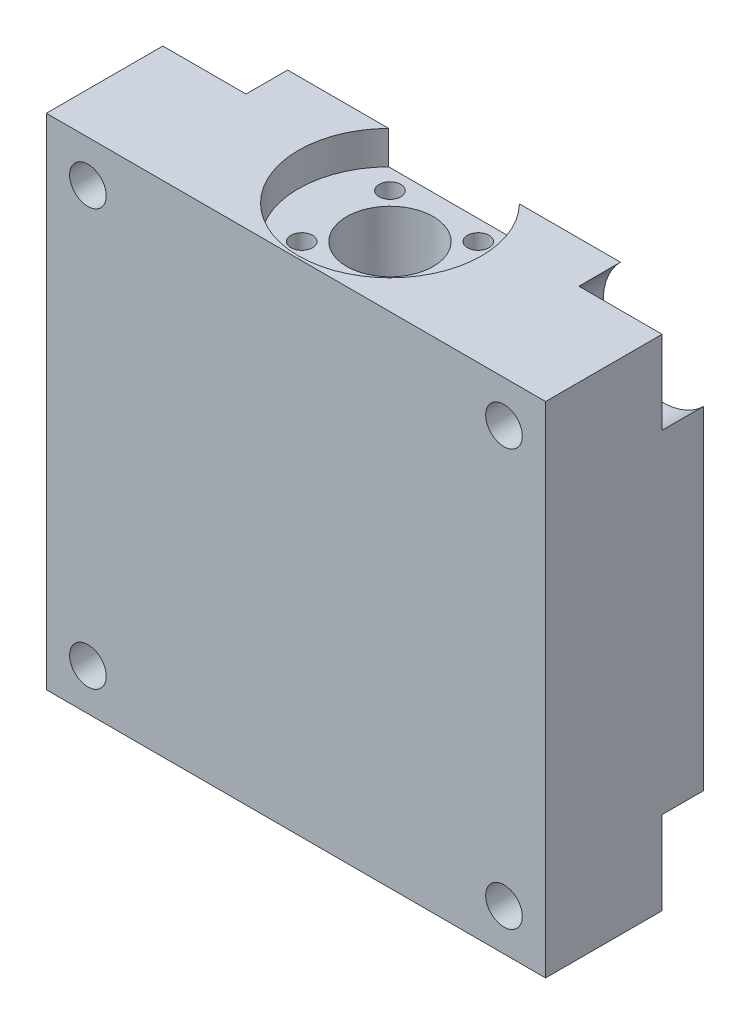
ISO-10303-21;
HEADER;
FILE_DESCRIPTION(('STEP AP214'),'2;1');
FILE_NAME('part.step','',(''),(''),'','','');
FILE_SCHEMA(('AUTOMOTIVE_DESIGN { 1 0 10303 214 1 1 1 1 }'));
ENDSEC;
DATA;
#1=APPLICATION_CONTEXT('core data for automotive mechanical design processes');
#2=APPLICATION_PROTOCOL_DEFINITION('international standard','automotive_design',2000,#1);
#3=PRODUCT_CONTEXT('',#1,'mechanical');
#4=PRODUCT('Part','Part','',(#3));
#5=PRODUCT_RELATED_PRODUCT_CATEGORY('part','',(#4));
#6=PRODUCT_DEFINITION_FORMATION('','',#4);
#7=PRODUCT_DEFINITION_CONTEXT('part definition',#1,'design');
#8=PRODUCT_DEFINITION('design','',#6,#7);
#9=PRODUCT_DEFINITION_SHAPE('','',#8);
#10=(LENGTH_UNIT() NAMED_UNIT(*) SI_UNIT(.MILLI.,.METRE.));
#11=(NAMED_UNIT(*) PLANE_ANGLE_UNIT() SI_UNIT($,.RADIAN.));
#12=(NAMED_UNIT(*) SI_UNIT($,.STERADIAN.) SOLID_ANGLE_UNIT());
#13=UNCERTAINTY_MEASURE_WITH_UNIT(LENGTH_MEASURE(1.E-05),#10,'distance_accuracy_value','');
#14=(GEOMETRIC_REPRESENTATION_CONTEXT(3) GLOBAL_UNCERTAINTY_ASSIGNED_CONTEXT((#13)) GLOBAL_UNIT_ASSIGNED_CONTEXT((#10,
#11,#12)) REPRESENTATION_CONTEXT('',''));
#15=CARTESIAN_POINT('',(0.,0.,0.));
#16=DIRECTION('',(0.,0.,1.));
#17=DIRECTION('',(1.,0.,0.));
#18=AXIS2_PLACEMENT_3D('',#15,#16,#17);
#19=CARTESIAN_POINT('',(25.,-25.,19.));
#20=DIRECTION('',(0.,0.,-1.));
#21=DIRECTION('',(-1.,0.,0.));
#22=AXIS2_PLACEMENT_3D('',#19,#20,#21);
#23=CYLINDRICAL_SURFACE('',#22,2.2);
#24=CARTESIAN_POINT('',(25.,-25.,19.));
#25=DIRECTION('',(0.,0.,1.));
#26=DIRECTION('',(1.,0.,0.));
#27=AXIS2_PLACEMENT_3D('',#24,#25,#26);
#28=CIRCLE('',#27,2.2);
#29=CARTESIAN_POINT('',(27.2,-25.,19.));
#30=VERTEX_POINT('',#29);
#31=EDGE_CURVE('E293',#30,#30,#28,.T.);
#32=ORIENTED_EDGE('',*,*,#31,.T.);
#33=EDGE_LOOP('',(#32));
#34=FACE_BOUND('',#33,.T.);
#35=CARTESIAN_POINT('',(25.,-25.,5.));
#36=DIRECTION('',(0.,0.,-1.));
#37=DIRECTION('',(-1.,0.,0.));
#38=AXIS2_PLACEMENT_3D('',#35,#36,#37);
#39=CIRCLE('',#38,2.2);
#40=CARTESIAN_POINT('',(22.8,-25.,5.));
#41=VERTEX_POINT('',#40);
#42=EDGE_CURVE('E217',#41,#41,#39,.T.);
#43=ORIENTED_EDGE('',*,*,#42,.T.);
#44=EDGE_LOOP('',(#43));
#45=FACE_BOUND('',#44,.T.);
#46=ADVANCED_FACE('F33',(#34,#45),#23,.F.);
#47=CARTESIAN_POINT('',(-25.,-25.,19.));
#48=DIRECTION('',(0.,0.,-1.));
#49=DIRECTION('',(-1.,0.,0.));
#50=AXIS2_PLACEMENT_3D('',#47,#48,#49);
#51=CYLINDRICAL_SURFACE('',#50,2.2);
#52=CARTESIAN_POINT('',(-25.,-25.,19.));
#53=DIRECTION('',(0.,0.,1.));
#54=DIRECTION('',(1.,0.,0.));
#55=AXIS2_PLACEMENT_3D('',#52,#53,#54);
#56=CIRCLE('',#55,2.2);
#57=CARTESIAN_POINT('',(-22.8,-25.,19.));
#58=VERTEX_POINT('',#57);
#59=EDGE_CURVE('E290',#58,#58,#56,.T.);
#60=ORIENTED_EDGE('',*,*,#59,.T.);
#61=EDGE_LOOP('',(#60));
#62=FACE_BOUND('',#61,.T.);
#63=CARTESIAN_POINT('',(-25.,-25.,5.));
#64=DIRECTION('',(0.,0.,-1.));
#65=DIRECTION('',(-1.,0.,0.));
#66=AXIS2_PLACEMENT_3D('',#63,#64,#65);
#67=CIRCLE('',#66,2.2);
#68=CARTESIAN_POINT('',(-27.2,-25.,5.));
#69=VERTEX_POINT('',#68);
#70=EDGE_CURVE('E212',#69,#69,#67,.T.);
#71=ORIENTED_EDGE('',*,*,#70,.T.);
#72=EDGE_LOOP('',(#71));
#73=FACE_BOUND('',#72,.T.);
#74=ADVANCED_FACE('F355',(#62,#73),#51,.F.);
#75=CARTESIAN_POINT('',(-25.,25.,19.));
#76=DIRECTION('',(0.,0.,-1.));
#77=DIRECTION('',(-1.,0.,0.));
#78=AXIS2_PLACEMENT_3D('',#75,#76,#77);
#79=CYLINDRICAL_SURFACE('',#78,2.2);
#80=CARTESIAN_POINT('',(-25.,25.,19.));
#81=DIRECTION('',(0.,0.,1.));
#82=DIRECTION('',(1.,0.,0.));
#83=AXIS2_PLACEMENT_3D('',#80,#81,#82);
#84=CIRCLE('',#83,2.2);
#85=CARTESIAN_POINT('',(-22.8,25.,19.));
#86=VERTEX_POINT('',#85);
#87=EDGE_CURVE('E157',#86,#86,#84,.T.);
#88=ORIENTED_EDGE('',*,*,#87,.T.);
#89=EDGE_LOOP('',(#88));
#90=FACE_BOUND('',#89,.T.);
#91=CARTESIAN_POINT('',(-25.,25.,5.));
#92=DIRECTION('',(0.,0.,-1.));
#93=DIRECTION('',(-1.,0.,0.));
#94=AXIS2_PLACEMENT_3D('',#91,#92,#93);
#95=CIRCLE('',#94,2.2);
#96=CARTESIAN_POINT('',(-27.2,25.,5.));
#97=VERTEX_POINT('',#96);
#98=EDGE_CURVE('E205',#97,#97,#95,.T.);
#99=ORIENTED_EDGE('',*,*,#98,.T.);
#100=EDGE_LOOP('',(#99));
#101=FACE_BOUND('',#100,.T.);
#102=ADVANCED_FACE('F361',(#90,#101),#79,.F.);
#103=CARTESIAN_POINT('',(25.,25.,19.));
#104=DIRECTION('',(0.,0.,-1.));
#105=DIRECTION('',(-1.,0.,0.));
#106=AXIS2_PLACEMENT_3D('',#103,#104,#105);
#107=CYLINDRICAL_SURFACE('',#106,2.2);
#108=CARTESIAN_POINT('',(25.,25.,19.));
#109=DIRECTION('',(0.,0.,1.));
#110=DIRECTION('',(1.,0.,0.));
#111=AXIS2_PLACEMENT_3D('',#108,#109,#110);
#112=CIRCLE('',#111,2.2);
#113=CARTESIAN_POINT('',(27.2,25.,19.));
#114=VERTEX_POINT('',#113);
#115=EDGE_CURVE('E163',#114,#114,#112,.T.);
#116=ORIENTED_EDGE('',*,*,#115,.T.);
#117=EDGE_LOOP('',(#116));
#118=FACE_BOUND('',#117,.T.);
#119=CARTESIAN_POINT('',(25.,25.,5.));
#120=DIRECTION('',(0.,0.,-1.));
#121=DIRECTION('',(-1.,0.,0.));
#122=AXIS2_PLACEMENT_3D('',#119,#120,#121);
#123=CIRCLE('',#122,2.2);
#124=CARTESIAN_POINT('',(22.8,25.,5.));
#125=VERTEX_POINT('',#124);
#126=EDGE_CURVE('E197',#125,#125,#123,.T.);
#127=ORIENTED_EDGE('',*,*,#126,.T.);
#128=EDGE_LOOP('',(#127));
#129=FACE_BOUND('',#128,.T.);
#130=ADVANCED_FACE('F365',(#118,#129),#107,.F.);
#131=CARTESIAN_POINT('',(0.,-30.001,7.7));
#132=DIRECTION('',(0.,1.,0.));
#133=DIRECTION('',(0.,0.,1.));
#134=AXIS2_PLACEMENT_3D('',#131,#132,#133);
#135=CYLINDRICAL_SURFACE('',#134,5.2);
#136=CARTESIAN_POINT('',(0.,26.,7.7));
#137=DIRECTION('',(0.,1.,0.));
#138=DIRECTION('',(0.,0.,1.));
#139=AXIS2_PLACEMENT_3D('',#136,#137,#138);
#140=CIRCLE('',#139,5.2);
#141=CARTESIAN_POINT('',(0.,26.,12.9));
#142=VERTEX_POINT('',#141);
#143=EDGE_CURVE('E195',#142,#142,#140,.T.);
#144=ORIENTED_EDGE('',*,*,#143,.T.);
#145=EDGE_LOOP('',(#144));
#146=FACE_BOUND('',#145,.T.);
#147=CARTESIAN_POINT('',(0.,16.,7.7));
#148=DIRECTION('',(0.,-1.,0.));
#149=DIRECTION('',(0.,0.,-1.));
#150=AXIS2_PLACEMENT_3D('',#147,#148,#149);
#151=CIRCLE('',#150,5.2);
#152=CARTESIAN_POINT('',(0.,16.,2.5));
#153=VERTEX_POINT('',#152);
#154=EDGE_CURVE('E192',#153,#153,#151,.F.);
#155=ORIENTED_EDGE('',*,*,#154,.F.);
#156=EDGE_LOOP('',(#155));
#157=FACE_BOUND('',#156,.T.);
#158=ADVANCED_FACE('F368',(#146,#157),#135,.F.);
#159=CARTESIAN_POINT('',(0.,0.,19.));
#160=DIRECTION('',(0.,0.,1.));
#161=DIRECTION('',(1.,0.,0.));
#162=AXIS2_PLACEMENT_3D('',#159,#160,#161);
#163=PLANE('',#162);
#164=ORIENTED_EDGE('',*,*,#31,.F.);
#165=EDGE_LOOP('',(#164));
#166=FACE_BOUND('',#165,.T.);
#167=ORIENTED_EDGE('',*,*,#87,.F.);
#168=EDGE_LOOP('',(#167));
#169=FACE_BOUND('',#168,.T.);
#170=DIRECTION('',(0.,1.,0.));
#171=VECTOR('',#170,1.);
#172=CARTESIAN_POINT('',(30.,30.,19.));
#173=LINE('',#172,#171);
#174=CARTESIAN_POINT('',(30.,-30.,19.));
#175=VERTEX_POINT('',#174);
#176=CARTESIAN_POINT('',(30.,30.,19.));
#177=VERTEX_POINT('',#176);
#178=EDGE_CURVE('E174',#175,#177,#173,.T.);
#179=ORIENTED_EDGE('',*,*,#178,.T.);
#180=DIRECTION('',(-1.,0.,0.));
#181=VECTOR('',#180,1.);
#182=CARTESIAN_POINT('',(-30.,30.,19.));
#183=LINE('',#182,#181);
#184=CARTESIAN_POINT('',(-30.,30.,19.));
#185=VERTEX_POINT('',#184);
#186=EDGE_CURVE('E300',#177,#185,#183,.T.);
#187=ORIENTED_EDGE('',*,*,#186,.T.);
#188=DIRECTION('',(0.,-1.,0.));
#189=VECTOR('',#188,1.);
#190=CARTESIAN_POINT('',(-30.,30.,19.));
#191=LINE('',#190,#189);
#192=CARTESIAN_POINT('',(-30.,-30.,19.));
#193=VERTEX_POINT('',#192);
#194=EDGE_CURVE('E301',#185,#193,#191,.T.);
#195=ORIENTED_EDGE('',*,*,#194,.T.);
#196=DIRECTION('',(1.,0.,0.));
#197=VECTOR('',#196,1.);
#198=CARTESIAN_POINT('',(-30.,-30.,19.));
#199=LINE('',#198,#197);
#200=EDGE_CURVE('E166',#193,#175,#199,.T.);
#201=ORIENTED_EDGE('',*,*,#200,.T.);
#202=EDGE_LOOP('',(#179,#187,#195,#201));
#203=FACE_BOUND('',#202,.T.);
#204=ORIENTED_EDGE('',*,*,#115,.F.);
#205=EDGE_LOOP('',(#204));
#206=FACE_BOUND('',#205,.T.);
#207=ORIENTED_EDGE('',*,*,#59,.F.);
#208=EDGE_LOOP('',(#207));
#209=FACE_BOUND('',#208,.T.);
#210=ADVANCED_FACE('F307',(#166,#169,#203,#206,#209),#163,.T.);
#211=CARTESIAN_POINT('',(0.,0.,0.));
#212=DIRECTION('',(0.,0.,1.));
#213=DIRECTION('',(1.,0.,0.));
#214=AXIS2_PLACEMENT_3D('',#211,#212,#213);
#215=PLANE('',#214);
#216=DIRECTION('',(0.,1.,0.));
#217=VECTOR('',#216,1.);
#218=CARTESIAN_POINT('',(30.,30.,0.));
#219=LINE('',#218,#217);
#220=CARTESIAN_POINT('',(30.,-20.,0.));
#221=VERTEX_POINT('',#220);
#222=CARTESIAN_POINT('',(30.,20.,0.));
#223=VERTEX_POINT('',#222);
#224=EDGE_CURVE('E147',#221,#223,#219,.T.);
#225=ORIENTED_EDGE('',*,*,#224,.F.);
#226=CARTESIAN_POINT('',(25.,-25.,0.));
#227=DIRECTION('',(0.,0.,-1.));
#228=DIRECTION('',(-1.,0.,0.));
#229=AXIS2_PLACEMENT_3D('',#226,#227,#228);
#230=CIRCLE('',#229,7.07106781186547);
#231=CARTESIAN_POINT('',(20.,-30.,0.));
#232=VERTEX_POINT('',#231);
#233=EDGE_CURVE('E134',#232,#221,#230,.T.);
#234=ORIENTED_EDGE('',*,*,#233,.F.);
#235=DIRECTION('',(1.,0.,0.));
#236=VECTOR('',#235,1.);
#237=CARTESIAN_POINT('',(-30.,-30.,0.));
#238=LINE('',#237,#236);
#239=CARTESIAN_POINT('',(-20.,-30.,0.));
#240=VERTEX_POINT('',#239);
#241=EDGE_CURVE('E172',#240,#232,#238,.T.);
#242=ORIENTED_EDGE('',*,*,#241,.F.);
#243=CARTESIAN_POINT('',(-25.,-25.,0.));
#244=DIRECTION('',(0.,0.,-1.));
#245=DIRECTION('',(-1.,0.,0.));
#246=AXIS2_PLACEMENT_3D('',#243,#244,#245);
#247=CIRCLE('',#246,7.07106781186546);
#248=CARTESIAN_POINT('',(-30.,-20.,0.));
#249=VERTEX_POINT('',#248);
#250=EDGE_CURVE('E150',#249,#240,#247,.T.);
#251=ORIENTED_EDGE('',*,*,#250,.F.);
#252=DIRECTION('',(0.,-1.,0.));
#253=VECTOR('',#252,1.);
#254=CARTESIAN_POINT('',(-30.,30.,0.));
#255=LINE('',#254,#253);
#256=CARTESIAN_POINT('',(-30.,20.,0.));
#257=VERTEX_POINT('',#256);
#258=EDGE_CURVE('E169',#257,#249,#255,.T.);
#259=ORIENTED_EDGE('',*,*,#258,.F.);
#260=CARTESIAN_POINT('',(-25.,25.,0.));
#261=DIRECTION('',(0.,0.,-1.));
#262=DIRECTION('',(-1.,0.,0.));
#263=AXIS2_PLACEMENT_3D('',#260,#261,#262);
#264=CIRCLE('',#263,7.07106781186548);
#265=CARTESIAN_POINT('',(-20.,30.,0.));
#266=VERTEX_POINT('',#265);
#267=EDGE_CURVE('E234',#266,#257,#264,.T.);
#268=ORIENTED_EDGE('',*,*,#267,.F.);
#269=DIRECTION('',(-1.,0.,0.));
#270=VECTOR('',#269,1.);
#271=CARTESIAN_POINT('',(-30.,30.,0.));
#272=LINE('',#271,#270);
#273=CARTESIAN_POINT('',(-7.85557127139713,30.,0.));
#274=VERTEX_POINT('',#273);
#275=EDGE_CURVE('E156',#274,#266,#272,.T.);
#276=ORIENTED_EDGE('',*,*,#275,.F.);
#277=DIRECTION('',(0.,1.,0.));
#278=VECTOR('',#277,1.);
#279=CARTESIAN_POINT('',(-7.85557127139713,26.,0.));
#280=LINE('',#279,#278);
#281=CARTESIAN_POINT('',(-7.85557127139713,26.,0.));
#282=VERTEX_POINT('',#281);
#283=EDGE_CURVE('E284',#274,#282,#280,.F.);
#284=ORIENTED_EDGE('',*,*,#283,.T.);
#285=DIRECTION('',(-1.,0.,0.));
#286=VECTOR('',#285,1.);
#287=CARTESIAN_POINT('',(0.,26.,0.));
#288=LINE('',#287,#286);
#289=CARTESIAN_POINT('',(7.85557127139713,26.,0.));
#290=VERTEX_POINT('',#289);
#291=EDGE_CURVE('E189',#290,#282,#288,.T.);
#292=ORIENTED_EDGE('',*,*,#291,.F.);
#293=DIRECTION('',(0.,1.,0.));
#294=VECTOR('',#293,1.);
#295=CARTESIAN_POINT('',(7.85557127139713,26.,0.));
#296=LINE('',#295,#294);
#297=CARTESIAN_POINT('',(7.85557127139713,30.,0.));
#298=VERTEX_POINT('',#297);
#299=EDGE_CURVE('E287',#290,#298,#296,.T.);
#300=ORIENTED_EDGE('',*,*,#299,.T.);
#301=CARTESIAN_POINT('',(20.,30.,0.));
#302=VERTEX_POINT('',#301);
#303=EDGE_CURVE('E160',#302,#298,#272,.T.);
#304=ORIENTED_EDGE('',*,*,#303,.F.);
#305=CARTESIAN_POINT('',(25.,25.,0.));
#306=DIRECTION('',(0.,0.,-1.));
#307=DIRECTION('',(-1.,0.,0.));
#308=AXIS2_PLACEMENT_3D('',#305,#306,#307);
#309=CIRCLE('',#308,7.07106781186548);
#310=EDGE_CURVE('E155',#223,#302,#309,.T.);
#311=ORIENTED_EDGE('',*,*,#310,.F.);
#312=EDGE_LOOP('',(#225,#234,#242,#251,#259,#268,#276,#284,#292,#300,#304,#311));
#313=FACE_BOUND('',#312,.T.);
#314=ADVANCED_FACE('F153',(#313),#215,.F.);
#315=CARTESIAN_POINT('',(30.,30.,19.));
#316=DIRECTION('',(-1.,0.,0.));
#317=DIRECTION('',(0.,-1.,0.));
#318=AXIS2_PLACEMENT_3D('',#315,#316,#317);
#319=PLANE('',#318);
#320=DIRECTION('',(0.,-1.,0.));
#321=VECTOR('',#320,1.);
#322=CARTESIAN_POINT('',(30.,30.,5.));
#323=LINE('',#322,#321);
#324=CARTESIAN_POINT('',(30.,-20.,5.));
#325=VERTEX_POINT('',#324);
#326=CARTESIAN_POINT('',(30.,-30.,5.));
#327=VERTEX_POINT('',#326);
#328=EDGE_CURVE('E48',#325,#327,#323,.T.);
#329=ORIENTED_EDGE('',*,*,#328,.F.);
#330=DIRECTION('',(0.,0.,-1.));
#331=VECTOR('',#330,1.);
#332=CARTESIAN_POINT('',(30.,-20.,5.));
#333=LINE('',#332,#331);
#334=EDGE_CURVE('E138',#325,#221,#333,.T.);
#335=ORIENTED_EDGE('',*,*,#334,.T.);
#336=ORIENTED_EDGE('',*,*,#224,.T.);
#337=DIRECTION('',(0.,0.,-1.));
#338=VECTOR('',#337,1.);
#339=CARTESIAN_POINT('',(30.,20.,5.));
#340=LINE('',#339,#338);
#341=CARTESIAN_POINT('',(30.,20.,5.));
#342=VERTEX_POINT('',#341);
#343=EDGE_CURVE('E248',#223,#342,#340,.F.);
#344=ORIENTED_EDGE('',*,*,#343,.T.);
#345=DIRECTION('',(0.,-1.,0.));
#346=VECTOR('',#345,1.);
#347=CARTESIAN_POINT('',(30.,30.,5.));
#348=LINE('',#347,#346);
#349=CARTESIAN_POINT('',(30.,30.,5.));
#350=VERTEX_POINT('',#349);
#351=EDGE_CURVE('E246',#350,#342,#348,.T.);
#352=ORIENTED_EDGE('',*,*,#351,.F.);
#353=DIRECTION('',(0.,0.,-1.));
#354=VECTOR('',#353,1.);
#355=CARTESIAN_POINT('',(30.,30.,19.));
#356=LINE('',#355,#354);
#357=EDGE_CURVE('E183',#177,#350,#356,.T.);
#358=ORIENTED_EDGE('',*,*,#357,.F.);
#359=ORIENTED_EDGE('',*,*,#178,.F.);
#360=DIRECTION('',(0.,0.,-1.));
#361=VECTOR('',#360,1.);
#362=CARTESIAN_POINT('',(30.,-30.,19.));
#363=LINE('',#362,#361);
#364=EDGE_CURVE('E175',#175,#327,#363,.T.);
#365=ORIENTED_EDGE('',*,*,#364,.T.);
#366=EDGE_LOOP('',(#329,#335,#336,#344,#352,#358,#359,#365));
#367=FACE_BOUND('',#366,.T.);
#368=ADVANCED_FACE('F35',(#367),#319,.F.);
#369=CARTESIAN_POINT('',(-30.,30.,19.));
#370=DIRECTION('',(0.,-1.,0.));
#371=DIRECTION('',(0.,0.,-1.));
#372=AXIS2_PLACEMENT_3D('',#369,#370,#371);
#373=PLANE('',#372);
#374=ORIENTED_EDGE('',*,*,#275,.T.);
#375=DIRECTION('',(0.,0.,-1.));
#376=VECTOR('',#375,1.);
#377=CARTESIAN_POINT('',(-20.,30.,5.));
#378=LINE('',#377,#376);
#379=CARTESIAN_POINT('',(-20.,30.,5.));
#380=VERTEX_POINT('',#379);
#381=EDGE_CURVE('E240',#266,#380,#378,.F.);
#382=ORIENTED_EDGE('',*,*,#381,.T.);
#383=DIRECTION('',(1.,0.,0.));
#384=VECTOR('',#383,1.);
#385=CARTESIAN_POINT('',(-30.,30.,5.));
#386=LINE('',#385,#384);
#387=CARTESIAN_POINT('',(-30.,30.,5.));
#388=VERTEX_POINT('',#387);
#389=EDGE_CURVE('E238',#388,#380,#386,.T.);
#390=ORIENTED_EDGE('',*,*,#389,.F.);
#391=DIRECTION('',(0.,0.,-1.));
#392=VECTOR('',#391,1.);
#393=CARTESIAN_POINT('',(-30.,30.,19.));
#394=LINE('',#393,#392);
#395=EDGE_CURVE('E180',#185,#388,#394,.T.);
#396=ORIENTED_EDGE('',*,*,#395,.F.);
#397=ORIENTED_EDGE('',*,*,#186,.F.);
#398=ORIENTED_EDGE('',*,*,#357,.T.);
#399=DIRECTION('',(1.,0.,0.));
#400=VECTOR('',#399,1.);
#401=CARTESIAN_POINT('',(-30.,30.,5.));
#402=LINE('',#401,#400);
#403=CARTESIAN_POINT('',(20.,30.,5.));
#404=VERTEX_POINT('',#403);
#405=EDGE_CURVE('E200',#404,#350,#402,.T.);
#406=ORIENTED_EDGE('',*,*,#405,.F.);
#407=DIRECTION('',(0.,0.,-1.));
#408=VECTOR('',#407,1.);
#409=CARTESIAN_POINT('',(20.,30.,5.));
#410=LINE('',#409,#408);
#411=EDGE_CURVE('E191',#404,#302,#410,.T.);
#412=ORIENTED_EDGE('',*,*,#411,.T.);
#413=ORIENTED_EDGE('',*,*,#303,.T.);
#414=CARTESIAN_POINT('',(0.,30.,7.7));
#415=DIRECTION('',(0.,-1.,0.));
#416=DIRECTION('',(0.,0.,-1.));
#417=AXIS2_PLACEMENT_3D('',#414,#415,#416);
#418=CIRCLE('',#417,11.);
#419=EDGE_CURVE('E186',#298,#274,#418,.T.);
#420=ORIENTED_EDGE('',*,*,#419,.T.);
#421=EDGE_LOOP('',(#374,#382,#390,#396,#397,#398,#406,#412,#413,#420));
#422=FACE_BOUND('',#421,.T.);
#423=ADVANCED_FACE('F316',(#422),#373,.F.);
#424=CARTESIAN_POINT('',(-30.,30.,19.));
#425=DIRECTION('',(1.,0.,0.));
#426=DIRECTION('',(0.,1.,0.));
#427=AXIS2_PLACEMENT_3D('',#424,#425,#426);
#428=PLANE('',#427);
#429=ORIENTED_EDGE('',*,*,#258,.T.);
#430=DIRECTION('',(0.,0.,-1.));
#431=VECTOR('',#430,1.);
#432=CARTESIAN_POINT('',(-30.,-20.,5.));
#433=LINE('',#432,#431);
#434=CARTESIAN_POINT('',(-30.,-20.,5.));
#435=VERTEX_POINT('',#434);
#436=EDGE_CURVE('E231',#249,#435,#433,.F.);
#437=ORIENTED_EDGE('',*,*,#436,.T.);
#438=DIRECTION('',(0.,1.,0.));
#439=VECTOR('',#438,1.);
#440=CARTESIAN_POINT('',(-30.,30.,5.));
#441=LINE('',#440,#439);
#442=CARTESIAN_POINT('',(-30.,-30.,5.));
#443=VERTEX_POINT('',#442);
#444=EDGE_CURVE('E229',#443,#435,#441,.T.);
#445=ORIENTED_EDGE('',*,*,#444,.F.);
#446=DIRECTION('',(0.,0.,-1.));
#447=VECTOR('',#446,1.);
#448=CARTESIAN_POINT('',(-30.,-30.,19.));
#449=LINE('',#448,#447);
#450=EDGE_CURVE('E177',#193,#443,#449,.T.);
#451=ORIENTED_EDGE('',*,*,#450,.F.);
#452=ORIENTED_EDGE('',*,*,#194,.F.);
#453=ORIENTED_EDGE('',*,*,#395,.T.);
#454=DIRECTION('',(0.,1.,0.));
#455=VECTOR('',#454,1.);
#456=CARTESIAN_POINT('',(-30.,30.,5.));
#457=LINE('',#456,#455);
#458=CARTESIAN_POINT('',(-30.,20.,5.));
#459=VERTEX_POINT('',#458);
#460=EDGE_CURVE('E208',#459,#388,#457,.T.);
#461=ORIENTED_EDGE('',*,*,#460,.F.);
#462=DIRECTION('',(0.,0.,-1.));
#463=VECTOR('',#462,1.);
#464=CARTESIAN_POINT('',(-30.,20.,5.));
#465=LINE('',#464,#463);
#466=EDGE_CURVE('E204',#459,#257,#465,.T.);
#467=ORIENTED_EDGE('',*,*,#466,.T.);
#468=EDGE_LOOP('',(#429,#437,#445,#451,#452,#453,#461,#467));
#469=FACE_BOUND('',#468,.T.);
#470=ADVANCED_FACE('F321',(#469),#428,.F.);
#471=CARTESIAN_POINT('',(-30.,-30.,19.));
#472=DIRECTION('',(0.,1.,0.));
#473=DIRECTION('',(0.,0.,1.));
#474=AXIS2_PLACEMENT_3D('',#471,#472,#473);
#475=PLANE('',#474);
#476=CARTESIAN_POINT('',(0.,-30.,7.7));
#477=DIRECTION('',(0.,-1.,0.));
#478=DIRECTION('',(0.,0.,-1.));
#479=AXIS2_PLACEMENT_3D('',#476,#477,#478);
#480=CIRCLE('',#479,7.2);
#481=CARTESIAN_POINT('',(0.,-30.,0.5));
#482=VERTEX_POINT('',#481);
#483=EDGE_CURVE('E272',#482,#482,#480,.T.);
#484=ORIENTED_EDGE('',*,*,#483,.F.);
#485=EDGE_LOOP('',(#484));
#486=FACE_BOUND('',#485,.T.);
#487=ORIENTED_EDGE('',*,*,#241,.T.);
#488=DIRECTION('',(0.,0.,-1.));
#489=VECTOR('',#488,1.);
#490=CARTESIAN_POINT('',(20.,-30.,5.));
#491=LINE('',#490,#489);
#492=CARTESIAN_POINT('',(20.,-30.,5.));
#493=VERTEX_POINT('',#492);
#494=EDGE_CURVE('E11',#232,#493,#491,.F.);
#495=ORIENTED_EDGE('',*,*,#494,.T.);
#496=DIRECTION('',(-1.,0.,0.));
#497=VECTOR('',#496,1.);
#498=CARTESIAN_POINT('',(-30.,-30.,5.));
#499=LINE('',#498,#497);
#500=EDGE_CURVE('E219',#327,#493,#499,.T.);
#501=ORIENTED_EDGE('',*,*,#500,.F.);
#502=ORIENTED_EDGE('',*,*,#364,.F.);
#503=ORIENTED_EDGE('',*,*,#200,.F.);
#504=ORIENTED_EDGE('',*,*,#450,.T.);
#505=DIRECTION('',(-1.,0.,0.));
#506=VECTOR('',#505,1.);
#507=CARTESIAN_POINT('',(-30.,-30.,5.));
#508=LINE('',#507,#506);
#509=CARTESIAN_POINT('',(-20.,-30.,5.));
#510=VERTEX_POINT('',#509);
#511=EDGE_CURVE('E215',#510,#443,#508,.T.);
#512=ORIENTED_EDGE('',*,*,#511,.F.);
#513=DIRECTION('',(0.,0.,-1.));
#514=VECTOR('',#513,1.);
#515=CARTESIAN_POINT('',(-20.,-30.,5.));
#516=LINE('',#515,#514);
#517=EDGE_CURVE('E41',#510,#240,#516,.T.);
#518=ORIENTED_EDGE('',*,*,#517,.T.);
#519=EDGE_LOOP('',(#487,#495,#501,#502,#503,#504,#512,#518));
#520=FACE_BOUND('',#519,.T.);
#521=ADVANCED_FACE('F312',(#486,#520),#475,.F.);
#522=CARTESIAN_POINT('',(0.,26.,7.7));
#523=DIRECTION('',(0.,1.,0.));
#524=DIRECTION('',(0.,0.,1.));
#525=AXIS2_PLACEMENT_3D('',#522,#523,#524);
#526=PLANE('',#525);
#527=CARTESIAN_POINT('',(-5.3033008588991,26.,13.0033008588991));
#528=DIRECTION('',(0.,1.,0.));
#529=DIRECTION('',(0.,0.,1.));
#530=AXIS2_PLACEMENT_3D('',#527,#528,#529);
#531=CIRCLE('',#530,1.3);
#532=CARTESIAN_POINT('',(-5.3033008588991,26.,14.3033008588991));
#533=VERTEX_POINT('',#532);
#534=EDGE_CURVE('E250',#533,#533,#531,.T.);
#535=ORIENTED_EDGE('',*,*,#534,.F.);
#536=EDGE_LOOP('',(#535));
#537=FACE_BOUND('',#536,.T.);
#538=CARTESIAN_POINT('',(5.30330085889912,26.,13.0033008588991));
#539=DIRECTION('',(0.,1.,0.));
#540=DIRECTION('',(0.,0.,1.));
#541=AXIS2_PLACEMENT_3D('',#538,#539,#540);
#542=CIRCLE('',#541,1.3);
#543=CARTESIAN_POINT('',(5.30330085889912,26.,14.3033008588991));
#544=VERTEX_POINT('',#543);
#545=EDGE_CURVE('E254',#544,#544,#542,.T.);
#546=ORIENTED_EDGE('',*,*,#545,.F.);
#547=EDGE_LOOP('',(#546));
#548=FACE_BOUND('',#547,.T.);
#549=CARTESIAN_POINT('',(5.3033008588991,26.,2.39669914110088));
#550=DIRECTION('',(0.,1.,0.));
#551=DIRECTION('',(0.,0.,1.));
#552=AXIS2_PLACEMENT_3D('',#549,#550,#551);
#553=CIRCLE('',#552,1.3);
#554=CARTESIAN_POINT('',(5.3033008588991,26.,3.69669914110088));
#555=VERTEX_POINT('',#554);
#556=EDGE_CURVE('E260',#555,#555,#553,.T.);
#557=ORIENTED_EDGE('',*,*,#556,.F.);
#558=EDGE_LOOP('',(#557));
#559=FACE_BOUND('',#558,.T.);
#560=CARTESIAN_POINT('',(-5.30330085889912,26.,2.3966991411009));
#561=DIRECTION('',(0.,1.,0.));
#562=DIRECTION('',(0.,0.,1.));
#563=AXIS2_PLACEMENT_3D('',#560,#561,#562);
#564=CIRCLE('',#563,1.3);
#565=CARTESIAN_POINT('',(-5.30330085889912,26.,3.6966991411009));
#566=VERTEX_POINT('',#565);
#567=EDGE_CURVE('E266',#566,#566,#564,.T.);
#568=ORIENTED_EDGE('',*,*,#567,.F.);
#569=EDGE_LOOP('',(#568));
#570=FACE_BOUND('',#569,.T.);
#571=ORIENTED_EDGE('',*,*,#143,.F.);
#572=EDGE_LOOP('',(#571));
#573=FACE_BOUND('',#572,.T.);
#574=ORIENTED_EDGE('',*,*,#291,.T.);
#575=CARTESIAN_POINT('',(0.,26.,7.7));
#576=DIRECTION('',(0.,1.,0.));
#577=DIRECTION('',(0.,0.,1.));
#578=AXIS2_PLACEMENT_3D('',#575,#576,#577);
#579=CIRCLE('',#578,11.);
#580=EDGE_CURVE('E281',#282,#290,#579,.T.);
#581=ORIENTED_EDGE('',*,*,#580,.T.);
#582=EDGE_LOOP('',(#574,#581));
#583=FACE_BOUND('',#582,.T.);
#584=ADVANCED_FACE('F339',(#537,#548,#559,#570,#573,#583),#526,.T.);
#585=CARTESIAN_POINT('',(0.,26.,7.7));
#586=DIRECTION('',(0.,1.,0.));
#587=DIRECTION('',(0.,0.,1.));
#588=AXIS2_PLACEMENT_3D('',#585,#586,#587);
#589=CYLINDRICAL_SURFACE('',#588,11.);
#590=ORIENTED_EDGE('',*,*,#580,.F.);
#591=ORIENTED_EDGE('',*,*,#283,.F.);
#592=ORIENTED_EDGE('',*,*,#419,.F.);
#593=ORIENTED_EDGE('',*,*,#299,.F.);
#594=EDGE_LOOP('',(#590,#591,#592,#593));
#595=FACE_BOUND('',#594,.T.);
#596=ADVANCED_FACE('F336',(#595),#589,.F.);
#597=CARTESIAN_POINT('',(0.,16.,7.7));
#598=DIRECTION('',(0.,-1.,0.));
#599=DIRECTION('',(0.,0.,-1.));
#600=AXIS2_PLACEMENT_3D('',#597,#598,#599);
#601=PLANE('',#600);
#602=CARTESIAN_POINT('',(0.,16.,7.7));
#603=DIRECTION('',(0.,-1.,0.));
#604=DIRECTION('',(0.,0.,-1.));
#605=AXIS2_PLACEMENT_3D('',#602,#603,#604);
#606=CIRCLE('',#605,7.2);
#607=CARTESIAN_POINT('',(0.,16.,0.5));
#608=VERTEX_POINT('',#607);
#609=EDGE_CURVE('E196',#608,#608,#606,.T.);
#610=ORIENTED_EDGE('',*,*,#609,.T.);
#611=EDGE_LOOP('',(#610));
#612=FACE_BOUND('',#611,.T.);
#613=ORIENTED_EDGE('',*,*,#154,.T.);
#614=EDGE_LOOP('',(#613));
#615=FACE_BOUND('',#614,.T.);
#616=ADVANCED_FACE('F347',(#612,#615),#601,.T.);
#617=CARTESIAN_POINT('',(0.,16.,7.7));
#618=DIRECTION('',(0.,-1.,0.));
#619=DIRECTION('',(0.,0.,-1.));
#620=AXIS2_PLACEMENT_3D('',#617,#618,#619);
#621=CYLINDRICAL_SURFACE('',#620,7.2);
#622=ORIENTED_EDGE('',*,*,#609,.F.);
#623=EDGE_LOOP('',(#622));
#624=FACE_BOUND('',#623,.T.);
#625=ORIENTED_EDGE('',*,*,#483,.T.);
#626=EDGE_LOOP('',(#625));
#627=FACE_BOUND('',#626,.T.);
#628=ADVANCED_FACE('F499',(#624,#627),#621,.F.);
#629=CARTESIAN_POINT('',(-5.30330085889912,20.,2.3966991411009));
#630=DIRECTION('',(0.,1.,0.));
#631=DIRECTION('',(0.,0.,1.));
#632=AXIS2_PLACEMENT_3D('',#629,#630,#631);
#633=CYLINDRICAL_SURFACE('',#632,1.3);
#634=CARTESIAN_POINT('',(-5.30330085889912,20.,2.3966991411009));
#635=DIRECTION('',(0.,1.,0.));
#636=DIRECTION('',(0.,0.,1.));
#637=AXIS2_PLACEMENT_3D('',#634,#635,#636);
#638=CIRCLE('',#637,1.3);
#639=CARTESIAN_POINT('',(-5.30330085889912,20.,3.6966991411009));
#640=VERTEX_POINT('',#639);
#641=EDGE_CURVE('E269',#640,#640,#638,.T.);
#642=ORIENTED_EDGE('',*,*,#641,.F.);
#643=EDGE_LOOP('',(#642));
#644=FACE_BOUND('',#643,.T.);
#645=ORIENTED_EDGE('',*,*,#567,.T.);
#646=EDGE_LOOP('',(#645));
#647=FACE_BOUND('',#646,.T.);
#648=ADVANCED_FACE('F490',(#644,#647),#633,.F.);
#649=CARTESIAN_POINT('',(-5.30330085889912,20.,2.3966991411009));
#650=DIRECTION('',(0.,1.,0.));
#651=DIRECTION('',(0.,0.,1.));
#652=AXIS2_PLACEMENT_3D('',#649,#650,#651);
#653=PLANE('',#652);
#654=ORIENTED_EDGE('',*,*,#641,.T.);
#655=EDGE_LOOP('',(#654));
#656=FACE_BOUND('',#655,.T.);
#657=ADVANCED_FACE('F480',(#656),#653,.T.);
#658=CARTESIAN_POINT('',(5.3033008588991,20.,2.39669914110088));
#659=DIRECTION('',(0.,1.,0.));
#660=DIRECTION('',(0.,0.,1.));
#661=AXIS2_PLACEMENT_3D('',#658,#659,#660);
#662=CYLINDRICAL_SURFACE('',#661,1.3);
#663=CARTESIAN_POINT('',(5.3033008588991,20.,2.39669914110088));
#664=DIRECTION('',(0.,1.,0.));
#665=DIRECTION('',(0.,0.,1.));
#666=AXIS2_PLACEMENT_3D('',#663,#664,#665);
#667=CIRCLE('',#666,1.3);
#668=CARTESIAN_POINT('',(5.3033008588991,20.,3.69669914110088));
#669=VERTEX_POINT('',#668);
#670=EDGE_CURVE('E263',#669,#669,#667,.T.);
#671=ORIENTED_EDGE('',*,*,#670,.F.);
#672=EDGE_LOOP('',(#671));
#673=FACE_BOUND('',#672,.T.);
#674=ORIENTED_EDGE('',*,*,#556,.T.);
#675=EDGE_LOOP('',(#674));
#676=FACE_BOUND('',#675,.T.);
#677=ADVANCED_FACE('F470',(#673,#676),#662,.F.);
#678=CARTESIAN_POINT('',(5.3033008588991,20.,2.39669914110088));
#679=DIRECTION('',(0.,1.,0.));
#680=DIRECTION('',(0.,0.,1.));
#681=AXIS2_PLACEMENT_3D('',#678,#679,#680);
#682=PLANE('',#681);
#683=ORIENTED_EDGE('',*,*,#670,.T.);
#684=EDGE_LOOP('',(#683));
#685=FACE_BOUND('',#684,.T.);
#686=ADVANCED_FACE('F460',(#685),#682,.T.);
#687=CARTESIAN_POINT('',(5.30330085889912,20.,13.0033008588991));
#688=DIRECTION('',(0.,1.,0.));
#689=DIRECTION('',(0.,0.,1.));
#690=AXIS2_PLACEMENT_3D('',#687,#688,#689);
#691=CYLINDRICAL_SURFACE('',#690,1.3);
#692=CARTESIAN_POINT('',(5.30330085889912,20.,13.0033008588991));
#693=DIRECTION('',(0.,1.,0.));
#694=DIRECTION('',(0.,0.,1.));
#695=AXIS2_PLACEMENT_3D('',#692,#693,#694);
#696=CIRCLE('',#695,1.3);
#697=CARTESIAN_POINT('',(5.30330085889912,20.,14.3033008588991));
#698=VERTEX_POINT('',#697);
#699=EDGE_CURVE('E257',#698,#698,#696,.T.);
#700=ORIENTED_EDGE('',*,*,#699,.F.);
#701=EDGE_LOOP('',(#700));
#702=FACE_BOUND('',#701,.T.);
#703=ORIENTED_EDGE('',*,*,#545,.T.);
#704=EDGE_LOOP('',(#703));
#705=FACE_BOUND('',#704,.T.);
#706=ADVANCED_FACE('F450',(#702,#705),#691,.F.);
#707=CARTESIAN_POINT('',(5.30330085889912,20.,13.0033008588991));
#708=DIRECTION('',(0.,1.,0.));
#709=DIRECTION('',(0.,0.,1.));
#710=AXIS2_PLACEMENT_3D('',#707,#708,#709);
#711=PLANE('',#710);
#712=ORIENTED_EDGE('',*,*,#699,.T.);
#713=EDGE_LOOP('',(#712));
#714=FACE_BOUND('',#713,.T.);
#715=ADVANCED_FACE('F440',(#714),#711,.T.);
#716=CARTESIAN_POINT('',(-5.3033008588991,20.,13.0033008588991));
#717=DIRECTION('',(0.,1.,0.));
#718=DIRECTION('',(0.,0.,1.));
#719=AXIS2_PLACEMENT_3D('',#716,#717,#718);
#720=CYLINDRICAL_SURFACE('',#719,1.3);
#721=CARTESIAN_POINT('',(-5.3033008588991,20.,13.0033008588991));
#722=DIRECTION('',(0.,1.,0.));
#723=DIRECTION('',(0.,0.,1.));
#724=AXIS2_PLACEMENT_3D('',#721,#722,#723);
#725=CIRCLE('',#724,1.3);
#726=CARTESIAN_POINT('',(-5.3033008588991,20.,14.3033008588991));
#727=VERTEX_POINT('',#726);
#728=EDGE_CURVE('E251',#727,#727,#725,.T.);
#729=ORIENTED_EDGE('',*,*,#728,.F.);
#730=EDGE_LOOP('',(#729));
#731=FACE_BOUND('',#730,.T.);
#732=ORIENTED_EDGE('',*,*,#534,.T.);
#733=EDGE_LOOP('',(#732));
#734=FACE_BOUND('',#733,.T.);
#735=ADVANCED_FACE('F429',(#731,#734),#720,.F.);
#736=CARTESIAN_POINT('',(-5.3033008588991,20.,13.0033008588991));
#737=DIRECTION('',(0.,1.,0.));
#738=DIRECTION('',(0.,0.,1.));
#739=AXIS2_PLACEMENT_3D('',#736,#737,#738);
#740=PLANE('',#739);
#741=ORIENTED_EDGE('',*,*,#728,.T.);
#742=EDGE_LOOP('',(#741));
#743=FACE_BOUND('',#742,.T.);
#744=ADVANCED_FACE('F423',(#743),#740,.T.);
#745=CARTESIAN_POINT('',(25.,25.,5.));
#746=DIRECTION('',(0.,0.,-1.));
#747=DIRECTION('',(-1.,0.,0.));
#748=AXIS2_PLACEMENT_3D('',#745,#746,#747);
#749=CYLINDRICAL_SURFACE('',#748,7.07106781186548);
#750=ORIENTED_EDGE('',*,*,#310,.T.);
#751=ORIENTED_EDGE('',*,*,#411,.F.);
#752=CARTESIAN_POINT('',(25.,25.,5.));
#753=DIRECTION('',(0.,0.,-1.));
#754=DIRECTION('',(-1.,0.,0.));
#755=AXIS2_PLACEMENT_3D('',#752,#753,#754);
#756=CIRCLE('',#755,7.07106781186548);
#757=EDGE_CURVE('E201',#342,#404,#756,.T.);
#758=ORIENTED_EDGE('',*,*,#757,.F.);
#759=ORIENTED_EDGE('',*,*,#343,.F.);
#760=EDGE_LOOP('',(#750,#751,#758,#759));
#761=FACE_BOUND('',#760,.T.);
#762=ADVANCED_FACE('F428',(#761),#749,.F.);
#763=CARTESIAN_POINT('',(25.,25.,5.));
#764=DIRECTION('',(0.,0.,-1.));
#765=DIRECTION('',(-1.,0.,0.));
#766=AXIS2_PLACEMENT_3D('',#763,#764,#765);
#767=PLANE('',#766);
#768=ORIENTED_EDGE('',*,*,#126,.F.);
#769=EDGE_LOOP('',(#768));
#770=FACE_BOUND('',#769,.T.);
#771=ORIENTED_EDGE('',*,*,#351,.T.);
#772=ORIENTED_EDGE('',*,*,#757,.T.);
#773=ORIENTED_EDGE('',*,*,#405,.T.);
#774=EDGE_LOOP('',(#771,#772,#773));
#775=FACE_BOUND('',#774,.T.);
#776=ADVANCED_FACE('F537',(#770,#775),#767,.T.);
#777=CARTESIAN_POINT('',(-25.,25.,5.));
#778=DIRECTION('',(0.,0.,-1.));
#779=DIRECTION('',(-1.,0.,0.));
#780=AXIS2_PLACEMENT_3D('',#777,#778,#779);
#781=CYLINDRICAL_SURFACE('',#780,7.07106781186548);
#782=ORIENTED_EDGE('',*,*,#267,.T.);
#783=ORIENTED_EDGE('',*,*,#466,.F.);
#784=CARTESIAN_POINT('',(-25.,25.,5.));
#785=DIRECTION('',(0.,0.,-1.));
#786=DIRECTION('',(-1.,0.,0.));
#787=AXIS2_PLACEMENT_3D('',#784,#785,#786);
#788=CIRCLE('',#787,7.07106781186548);
#789=EDGE_CURVE('E209',#380,#459,#788,.T.);
#790=ORIENTED_EDGE('',*,*,#789,.F.);
#791=ORIENTED_EDGE('',*,*,#381,.F.);
#792=EDGE_LOOP('',(#782,#783,#790,#791));
#793=FACE_BOUND('',#792,.T.);
#794=ADVANCED_FACE('F541',(#793),#781,.F.);
#795=CARTESIAN_POINT('',(-25.,25.,5.));
#796=DIRECTION('',(0.,0.,-1.));
#797=DIRECTION('',(-1.,0.,0.));
#798=AXIS2_PLACEMENT_3D('',#795,#796,#797);
#799=PLANE('',#798);
#800=ORIENTED_EDGE('',*,*,#98,.F.);
#801=EDGE_LOOP('',(#800));
#802=FACE_BOUND('',#801,.T.);
#803=ORIENTED_EDGE('',*,*,#389,.T.);
#804=ORIENTED_EDGE('',*,*,#789,.T.);
#805=ORIENTED_EDGE('',*,*,#460,.T.);
#806=EDGE_LOOP('',(#803,#804,#805));
#807=FACE_BOUND('',#806,.T.);
#808=ADVANCED_FACE('F545',(#802,#807),#799,.T.);
#809=CARTESIAN_POINT('',(-25.,-25.,5.));
#810=DIRECTION('',(0.,0.,-1.));
#811=DIRECTION('',(-1.,0.,0.));
#812=AXIS2_PLACEMENT_3D('',#809,#810,#811);
#813=CYLINDRICAL_SURFACE('',#812,7.07106781186546);
#814=ORIENTED_EDGE('',*,*,#250,.T.);
#815=ORIENTED_EDGE('',*,*,#517,.F.);
#816=CARTESIAN_POINT('',(-25.,-25.,5.));
#817=DIRECTION('',(0.,0.,-1.));
#818=DIRECTION('',(-1.,0.,0.));
#819=AXIS2_PLACEMENT_3D('',#816,#817,#818);
#820=CIRCLE('',#819,7.07106781186546);
#821=EDGE_CURVE('E56',#435,#510,#820,.T.);
#822=ORIENTED_EDGE('',*,*,#821,.F.);
#823=ORIENTED_EDGE('',*,*,#436,.F.);
#824=EDGE_LOOP('',(#814,#815,#822,#823));
#825=FACE_BOUND('',#824,.T.);
#826=ADVANCED_FACE('F326',(#825),#813,.F.);
#827=CARTESIAN_POINT('',(-25.,-25.,5.));
#828=DIRECTION('',(0.,0.,-1.));
#829=DIRECTION('',(-1.,0.,0.));
#830=AXIS2_PLACEMENT_3D('',#827,#828,#829);
#831=PLANE('',#830);
#832=ORIENTED_EDGE('',*,*,#70,.F.);
#833=EDGE_LOOP('',(#832));
#834=FACE_BOUND('',#833,.T.);
#835=ORIENTED_EDGE('',*,*,#444,.T.);
#836=ORIENTED_EDGE('',*,*,#821,.T.);
#837=ORIENTED_EDGE('',*,*,#511,.T.);
#838=EDGE_LOOP('',(#835,#836,#837));
#839=FACE_BOUND('',#838,.T.);
#840=ADVANCED_FACE('F324',(#834,#839),#831,.T.);
#841=CARTESIAN_POINT('',(25.,-25.,5.));
#842=DIRECTION('',(0.,0.,-1.));
#843=DIRECTION('',(-1.,0.,0.));
#844=AXIS2_PLACEMENT_3D('',#841,#842,#843);
#845=CYLINDRICAL_SURFACE('',#844,7.07106781186547);
#846=CARTESIAN_POINT('',(25.,-25.,5.));
#847=DIRECTION('',(0.,0.,-1.));
#848=DIRECTION('',(-1.,0.,0.));
#849=AXIS2_PLACEMENT_3D('',#846,#847,#848);
#850=CIRCLE('',#849,7.07106781186547);
#851=EDGE_CURVE('E143',#493,#325,#850,.T.);
#852=ORIENTED_EDGE('',*,*,#851,.F.);
#853=ORIENTED_EDGE('',*,*,#494,.F.);
#854=ORIENTED_EDGE('',*,*,#233,.T.);
#855=ORIENTED_EDGE('',*,*,#334,.F.);
#856=EDGE_LOOP('',(#852,#853,#854,#855));
#857=FACE_BOUND('',#856,.T.);
#858=ADVANCED_FACE('F137',(#857),#845,.F.);
#859=CARTESIAN_POINT('',(25.,-25.,5.));
#860=DIRECTION('',(0.,0.,-1.));
#861=DIRECTION('',(-1.,0.,0.));
#862=AXIS2_PLACEMENT_3D('',#859,#860,#861);
#863=PLANE('',#862);
#864=ORIENTED_EDGE('',*,*,#42,.F.);
#865=EDGE_LOOP('',(#864));
#866=FACE_BOUND('',#865,.T.);
#867=ORIENTED_EDGE('',*,*,#328,.T.);
#868=ORIENTED_EDGE('',*,*,#500,.T.);
#869=ORIENTED_EDGE('',*,*,#851,.T.);
#870=EDGE_LOOP('',(#867,#868,#869));
#871=FACE_BOUND('',#870,.T.);
#872=ADVANCED_FACE('F556',(#866,#871),#863,.T.);
#873=CLOSED_SHELL('',(#46,#74,#102,#130,#158,#210,#314,#368,#423,#470,#521,#584,#596,#616,#628,
#648,#657,#677,#686,#706,#715,#735,#744,#762,#776,#794,#808,#826,#840,#858,#872));
#874=MANIFOLD_SOLID_BREP('B2',#873);
#875=ADVANCED_BREP_SHAPE_REPRESENTATION('',(#18,#874),#14);
#876=SHAPE_DEFINITION_REPRESENTATION(#9,#875);
ENDSEC;
END-ISO-10303-21;
